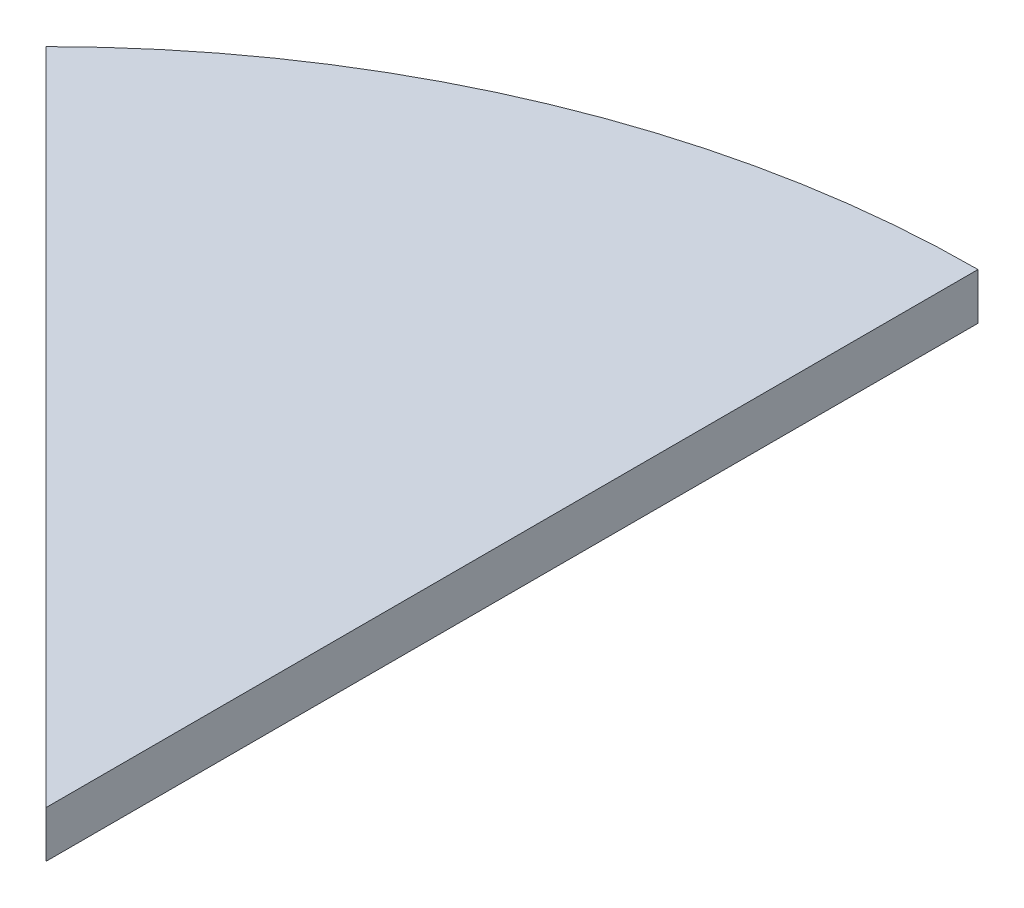
ISO-10303-21;
HEADER;
FILE_DESCRIPTION(('STEP AP214'),'2;1');
FILE_NAME('part.step','',(''),(''),'','','');
FILE_SCHEMA(('AUTOMOTIVE_DESIGN { 1 0 10303 214 1 1 1 1 }'));
ENDSEC;
DATA;
#1=APPLICATION_CONTEXT('core data for automotive mechanical design processes');
#2=APPLICATION_PROTOCOL_DEFINITION('international standard','automotive_design',2000,#1);
#3=PRODUCT_CONTEXT('',#1,'mechanical');
#4=PRODUCT('Part','Part','',(#3));
#5=PRODUCT_RELATED_PRODUCT_CATEGORY('part','',(#4));
#6=PRODUCT_DEFINITION_FORMATION('','',#4);
#7=PRODUCT_DEFINITION_CONTEXT('part definition',#1,'design');
#8=PRODUCT_DEFINITION('design','',#6,#7);
#9=PRODUCT_DEFINITION_SHAPE('','',#8);
#10=(LENGTH_UNIT() NAMED_UNIT(*) SI_UNIT(.MILLI.,.METRE.));
#11=(NAMED_UNIT(*) PLANE_ANGLE_UNIT() SI_UNIT($,.RADIAN.));
#12=(NAMED_UNIT(*) SI_UNIT($,.STERADIAN.) SOLID_ANGLE_UNIT());
#13=UNCERTAINTY_MEASURE_WITH_UNIT(LENGTH_MEASURE(1.E-05),#10,'distance_accuracy_value','');
#14=(GEOMETRIC_REPRESENTATION_CONTEXT(3) GLOBAL_UNCERTAINTY_ASSIGNED_CONTEXT((#13)) GLOBAL_UNIT_ASSIGNED_CONTEXT((#10,
#11,#12)) REPRESENTATION_CONTEXT('',''));
#15=CARTESIAN_POINT('',(0.,0.,0.));
#16=DIRECTION('',(0.,0.,1.));
#17=DIRECTION('',(1.,0.,0.));
#18=AXIS2_PLACEMENT_3D('',#15,#16,#17);
#19=CARTESIAN_POINT('',(0.,20.,0.));
#20=DIRECTION('',(0.707106781186548,0.,-0.707106781186548));
#21=DIRECTION('',(-0.707106781186548,0.,-0.707106781186548));
#22=AXIS2_PLACEMENT_3D('',#19,#20,#21);
#23=PLANE('',#22);
#24=DIRECTION('',(0.707106781186547,0.,0.707106781186547));
#25=VECTOR('',#24,1.);
#26=CARTESIAN_POINT('',(0.,0.,0.));
#27=LINE('',#26,#25);
#28=CARTESIAN_POINT('',(-282.842712474619,0.,-282.842712474619));
#29=VERTEX_POINT('',#28);
#30=CARTESIAN_POINT('',(0.,0.,0.));
#31=VERTEX_POINT('',#30);
#32=EDGE_CURVE('E77',#29,#31,#27,.T.);
#33=ORIENTED_EDGE('',*,*,#32,.T.);
#34=DIRECTION('',(0.,-1.,0.));
#35=VECTOR('',#34,1.);
#36=CARTESIAN_POINT('',(0.,20.,0.));
#37=LINE('',#36,#35);
#38=CARTESIAN_POINT('',(0.,20.,0.));
#39=VERTEX_POINT('',#38);
#40=EDGE_CURVE('E11',#39,#31,#37,.T.);
#41=ORIENTED_EDGE('',*,*,#40,.F.);
#42=DIRECTION('',(0.707106781186547,0.,0.707106781186547));
#43=VECTOR('',#42,1.);
#44=CARTESIAN_POINT('',(0.,20.,0.));
#45=LINE('',#44,#43);
#46=CARTESIAN_POINT('',(-282.842712474619,20.,-282.842712474619));
#47=VERTEX_POINT('',#46);
#48=EDGE_CURVE('E70',#47,#39,#45,.T.);
#49=ORIENTED_EDGE('',*,*,#48,.F.);
#50=DIRECTION('',(0.,-1.,0.));
#51=VECTOR('',#50,1.);
#52=CARTESIAN_POINT('',(-282.842712474619,20.,-282.842712474619));
#53=LINE('',#52,#51);
#54=EDGE_CURVE('E78',#47,#29,#53,.T.);
#55=ORIENTED_EDGE('',*,*,#54,.T.);
#56=EDGE_LOOP('',(#33,#41,#49,#55));
#57=FACE_BOUND('',#56,.T.);
#58=ADVANCED_FACE('F30',(#57),#23,.F.);
#59=CARTESIAN_POINT('',(0.,20.,-400.));
#60=DIRECTION('',(-1.,0.,0.));
#61=DIRECTION('',(0.,0.,1.));
#62=AXIS2_PLACEMENT_3D('',#59,#60,#61);
#63=PLANE('',#62);
#64=DIRECTION('',(0.,0.,-1.));
#65=VECTOR('',#64,1.);
#66=CARTESIAN_POINT('',(0.,0.,-400.));
#67=LINE('',#66,#65);
#68=CARTESIAN_POINT('',(0.,0.,-400.));
#69=VERTEX_POINT('',#68);
#70=EDGE_CURVE('E58',#31,#69,#67,.T.);
#71=ORIENTED_EDGE('',*,*,#70,.T.);
#72=DIRECTION('',(0.,-1.,0.));
#73=VECTOR('',#72,1.);
#74=CARTESIAN_POINT('',(0.,20.,-400.));
#75=LINE('',#74,#73);
#76=CARTESIAN_POINT('',(0.,20.,-400.));
#77=VERTEX_POINT('',#76);
#78=EDGE_CURVE('E38',#77,#69,#75,.T.);
#79=ORIENTED_EDGE('',*,*,#78,.F.);
#80=DIRECTION('',(0.,0.,-1.));
#81=VECTOR('',#80,1.);
#82=CARTESIAN_POINT('',(0.,20.,-400.));
#83=LINE('',#82,#81);
#84=EDGE_CURVE('E66',#39,#77,#83,.T.);
#85=ORIENTED_EDGE('',*,*,#84,.F.);
#86=ORIENTED_EDGE('',*,*,#40,.T.);
#87=EDGE_LOOP('',(#71,#79,#85,#86));
#88=FACE_BOUND('',#87,.T.);
#89=ADVANCED_FACE('F67',(#88),#63,.F.);
#90=CARTESIAN_POINT('',(0.,20.,0.));
#91=DIRECTION('',(0.,-1.,0.));
#92=DIRECTION('',(0.,0.,-1.));
#93=AXIS2_PLACEMENT_3D('',#90,#91,#92);
#94=CYLINDRICAL_SURFACE('',#93,400.);
#95=CARTESIAN_POINT('',(0.,0.,0.));
#96=DIRECTION('',(0.,1.,0.));
#97=DIRECTION('',(0.,0.,1.));
#98=AXIS2_PLACEMENT_3D('',#95,#96,#97);
#99=CIRCLE('',#98,400.);
#100=EDGE_CURVE('E63',#69,#29,#99,.T.);
#101=ORIENTED_EDGE('',*,*,#100,.T.);
#102=ORIENTED_EDGE('',*,*,#54,.F.);
#103=CARTESIAN_POINT('',(0.,20.,0.));
#104=DIRECTION('',(0.,1.,0.));
#105=DIRECTION('',(0.,0.,1.));
#106=AXIS2_PLACEMENT_3D('',#103,#104,#105);
#107=CIRCLE('',#106,400.);
#108=EDGE_CURVE('E46',#77,#47,#107,.T.);
#109=ORIENTED_EDGE('',*,*,#108,.F.);
#110=ORIENTED_EDGE('',*,*,#78,.T.);
#111=EDGE_LOOP('',(#101,#102,#109,#110));
#112=FACE_BOUND('',#111,.T.);
#113=ADVANCED_FACE('F85',(#112),#94,.T.);
#114=CARTESIAN_POINT('',(0.,20.,0.));
#115=DIRECTION('',(0.,1.,0.));
#116=DIRECTION('',(0.,0.,1.));
#117=AXIS2_PLACEMENT_3D('',#114,#115,#116);
#118=PLANE('',#117);
#119=ORIENTED_EDGE('',*,*,#48,.T.);
#120=ORIENTED_EDGE('',*,*,#84,.T.);
#121=ORIENTED_EDGE('',*,*,#108,.T.);
#122=EDGE_LOOP('',(#119,#120,#121));
#123=FACE_BOUND('',#122,.T.);
#124=ADVANCED_FACE('F73',(#123),#118,.T.);
#125=CARTESIAN_POINT('',(0.,0.,0.));
#126=DIRECTION('',(0.,1.,0.));
#127=DIRECTION('',(0.,0.,1.));
#128=AXIS2_PLACEMENT_3D('',#125,#126,#127);
#129=PLANE('',#128);
#130=ORIENTED_EDGE('',*,*,#32,.F.);
#131=ORIENTED_EDGE('',*,*,#100,.F.);
#132=ORIENTED_EDGE('',*,*,#70,.F.);
#133=EDGE_LOOP('',(#130,#131,#132));
#134=FACE_BOUND('',#133,.T.);
#135=ADVANCED_FACE('F86',(#134),#129,.F.);
#136=CLOSED_SHELL('',(#58,#89,#113,#124,#135));
#137=MANIFOLD_SOLID_BREP('B2',#136);
#138=ADVANCED_BREP_SHAPE_REPRESENTATION('',(#18,#137),#14);
#139=SHAPE_DEFINITION_REPRESENTATION(#9,#138);
ENDSEC;
END-ISO-10303-21;
